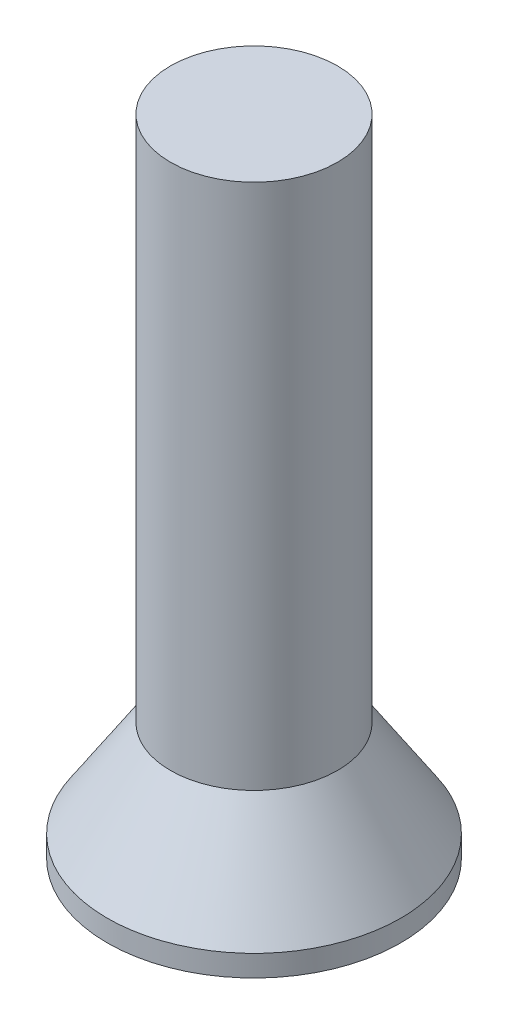
ISO-10303-21;
HEADER;
FILE_DESCRIPTION(('STEP AP214'),'2;1');
FILE_NAME('part.step','',(''),(''),'','','');
FILE_SCHEMA(('AUTOMOTIVE_DESIGN { 1 0 10303 214 1 1 1 1 }'));
ENDSEC;
DATA;
#1=APPLICATION_CONTEXT('core data for automotive mechanical design processes');
#2=APPLICATION_PROTOCOL_DEFINITION('international standard','automotive_design',2000,#1);
#3=PRODUCT_CONTEXT('',#1,'mechanical');
#4=PRODUCT('Part','Part','',(#3));
#5=PRODUCT_RELATED_PRODUCT_CATEGORY('part','',(#4));
#6=PRODUCT_DEFINITION_FORMATION('','',#4);
#7=PRODUCT_DEFINITION_CONTEXT('part definition',#1,'design');
#8=PRODUCT_DEFINITION('design','',#6,#7);
#9=PRODUCT_DEFINITION_SHAPE('','',#8);
#10=(LENGTH_UNIT() NAMED_UNIT(*) SI_UNIT(.MILLI.,.METRE.));
#11=(NAMED_UNIT(*) PLANE_ANGLE_UNIT() SI_UNIT($,.RADIAN.));
#12=(NAMED_UNIT(*) SI_UNIT($,.STERADIAN.) SOLID_ANGLE_UNIT());
#13=UNCERTAINTY_MEASURE_WITH_UNIT(LENGTH_MEASURE(1.E-05),#10,'distance_accuracy_value','');
#14=(GEOMETRIC_REPRESENTATION_CONTEXT(3) GLOBAL_UNCERTAINTY_ASSIGNED_CONTEXT((#13)) GLOBAL_UNIT_ASSIGNED_CONTEXT((#10,
#11,#12)) REPRESENTATION_CONTEXT('',''));
#15=CARTESIAN_POINT('',(0.,0.,0.));
#16=DIRECTION('',(0.,0.,1.));
#17=DIRECTION('',(1.,0.,0.));
#18=AXIS2_PLACEMENT_3D('',#15,#16,#17);
#19=CARTESIAN_POINT('',(0.,1.,0.));
#20=DIRECTION('',(0.,-1.,0.));
#21=DIRECTION('',(0.,0.,-1.));
#22=AXIS2_PLACEMENT_3D('',#19,#20,#21);
#23=CYLINDRICAL_SURFACE('',#22,6.85);
#24=CARTESIAN_POINT('',(-6.85,1.,0.));
#25=CARTESIAN_POINT('',(-6.84999812345427,0.999998671016254,-0.227513955360011));
#26=CARTESIAN_POINT('',(-6.83865302341798,1.0003211614898,-0.455067864432986));
#27=CARTESIAN_POINT('',(-6.79336509384239,1.00102410847341,-0.908046984716592));
#28=CARTESIAN_POINT('',(-6.75940731692302,1.00140460319696,-1.13347068779542));
#29=CARTESIAN_POINT('',(-6.66913555062974,1.00192474815454,-1.5802420142607));
#30=CARTESIAN_POINT('',(-6.61277952993837,1.0020639429301,-1.80158115092519));
#31=CARTESIAN_POINT('',(-6.47828634379006,1.00202979301861,-2.237477439852));
#32=CARTESIAN_POINT('',(-6.40015592107887,1.0018565449931,-2.4520366687433));
#33=CARTESIAN_POINT('',(-6.23666512093163,1.00133143729471,-2.83965489807855));
#34=CARTESIAN_POINT('',(-6.15430695043756,1.00101145779988,-3.01398808189051));
#35=CARTESIAN_POINT('',(-5.97516235080214,1.00031171588125,-3.35515428338137));
#36=CARTESIAN_POINT('',(-5.87837160264885,0.999931935559884,-3.52198503640646));
#37=CARTESIAN_POINT('',(-5.67119243566001,0.999218877528438,-3.84670348787193));
#38=CARTESIAN_POINT('',(-5.56081986326337,0.998885546574836,-4.00460130041875));
#39=CARTESIAN_POINT('',(-5.3271695379895,0.998352452619782,-4.31054673182821));
#40=CARTESIAN_POINT('',(-5.20389155353915,0.998152692015574,-4.45859417385903));
#41=CARTESIAN_POINT('',(-4.94525362740014,0.997937343125588,-4.74384311758573));
#42=CARTESIAN_POINT('',(-4.80988864483397,0.997921832045855,-4.88104004867619));
#43=CARTESIAN_POINT('',(-4.52808347540876,0.998079078317952,-5.14354356769262));
#44=CARTESIAN_POINT('',(-4.3816433154995,0.998251835211674,-5.2688501845502));
#45=CARTESIAN_POINT('',(-4.07869959935133,0.998741962088488,-5.50670538184579));
#46=CARTESIAN_POINT('',(-3.92219412964626,0.99905935963871,-5.61925152515062));
#47=CARTESIAN_POINT('',(-3.6002611149717,0.999755939477201,-5.83075577147306));
#48=CARTESIAN_POINT('',(-3.43483375788563,1.00013512046473,-5.92971416047575));
#49=CARTESIAN_POINT('',(-3.09621620096631,1.0008506448194,-6.11334967042798));
#50=CARTESIAN_POINT('',(-2.92302537046709,1.00118698469779,-6.19802562847301));
#51=CARTESIAN_POINT('',(-2.57018601202542,1.00171546852083,-6.35245757782905));
#52=CARTESIAN_POINT('',(-2.39053973702699,1.00190766226989,-6.42221871644692));
#53=CARTESIAN_POINT('',(-2.02598155929917,1.00208086232194,-6.54637178676389));
#54=CARTESIAN_POINT('',(-1.84106884899934,1.00206183606004,-6.60076134722049));
#55=CARTESIAN_POINT('',(-1.46731899006425,1.00181568028338,-6.6937702318287));
#56=CARTESIAN_POINT('',(-1.27848183892677,1.00158855063592,-6.73238954592486));
#57=CARTESIAN_POINT('',(-0.898227411436452,1.00102524830392,-6.79358313035189));
#58=CARTESIAN_POINT('',(-0.706810158337971,1.00068907660154,-6.81615754519639));
#59=CARTESIAN_POINT('',(-0.322754194419421,1.00016162949675,-6.84510144669493));
#60=CARTESIAN_POINT('',(-0.130115484561225,0.999970353980257,-6.85147094610843));
#61=CARTESIAN_POINT('',(0.255012935510077,1.00004587197948,-6.84795972186996));
#62=CARTESIAN_POINT('',(0.447502646282845,1.00031266376619,-6.83807905955514));
#63=CARTESIAN_POINT('',(0.830965586966271,1.00090256540496,-6.80213791000121));
#64=CARTESIAN_POINT('',(1.02193881521558,1.0012256753187,-6.77607740503916));
#65=CARTESIAN_POINT('',(1.4009811919649,1.00173692119812,-6.70796718995334));
#66=CARTESIAN_POINT('',(1.5890507981708,1.00192507865373,-6.66592002718989));
#67=CARTESIAN_POINT('',(1.96104492829404,1.00208361398727,-6.56611762153783));
#68=CARTESIAN_POINT('',(2.14496799411025,1.0020539164202,-6.50835694359796));
#69=CARTESIAN_POINT('',(2.50722923301826,1.00179355395321,-6.37756797332195));
#70=CARTESIAN_POINT('',(2.68556935946898,1.00156296017569,-6.30454509115059));
#71=CARTESIAN_POINT('',(3.03552998320523,1.000977643275,-6.14370869467194));
#72=CARTESIAN_POINT('',(3.20714798201641,1.00062287447633,-6.05588974407597));
#73=CARTESIAN_POINT('',(3.54233942546112,0.999893880774316,-5.86612433651913));
#74=CARTESIAN_POINT('',(3.70591454455936,0.999519659954391,-5.76418083719668));
#75=CARTESIAN_POINT('',(4.0238994351081,0.99885343019828,-5.54687463255295));
#76=CARTESIAN_POINT('',(4.17830901298925,0.998561422997897,-5.4315116439743));
#77=CARTESIAN_POINT('',(4.47685942182926,0.998135174399942,-5.18818982852143));
#78=CARTESIAN_POINT('',(4.62100038664985,0.998000930945407,-5.06023116589633));
#79=CARTESIAN_POINT('',(4.89799099508889,0.99792403422613,-4.79262644366971));
#80=CARTESIAN_POINT('',(5.03084063921721,0.997981380952737,-4.65298038459594));
#81=CARTESIAN_POINT('',(5.28430745934125,0.998273278758808,-4.36298987405243));
#82=CARTESIAN_POINT('',(5.40492431184354,0.998507834523141,-4.21264513983743));
#83=CARTESIAN_POINT('',(5.63306165888007,0.999094278225813,-3.9023327227402));
#84=CARTESIAN_POINT('',(5.74058242997871,0.999446163685786,-3.74236524317872));
#85=CARTESIAN_POINT('',(5.94178604045167,1.00017387959336,-3.41390941075433));
#86=CARTESIAN_POINT('',(6.03546617179838,1.00054971470636,-3.24541939902633));
#87=CARTESIAN_POINT('',(6.20826538371145,1.00121842150677,-2.90120874994971));
#88=CARTESIAN_POINT('',(6.28738981874729,1.00151132372339,-2.72549080069876));
#89=CARTESIAN_POINT('',(6.43058637630595,1.00192224080792,-2.36794433763354));
#90=CARTESIAN_POINT('',(6.49465251514832,1.00204018625219,-2.18611342742061));
#91=CARTESIAN_POINT('',(6.60721553155942,1.00205572477161,-1.81776640259537));
#92=CARTESIAN_POINT('',(6.65571814573939,1.00195339914466,-1.63125204166782));
#93=CARTESIAN_POINT('',(6.73684919080952,1.00156510961705,-1.25477293038916));
#94=CARTESIAN_POINT('',(6.76947468154498,1.00127911172636,-1.06480754772269));
#95=CARTESIAN_POINT('',(6.81860622146753,1.00067316301555,-0.682778608437009));
#96=CARTESIAN_POINT('',(6.83511227967763,1.00035321221443,-0.490715052992335));
#97=CARTESIAN_POINT('',(6.84769455137506,1.00006681162223,-0.202139120838173));
#98=CARTESIAN_POINT('',(6.84985876487775,1.00000360251516,-0.105857019683592));
#99=CARTESIAN_POINT('',(6.85012785711131,0.999996789835058,0.0867113328807578));
#100=CARTESIAN_POINT('',(6.84823280021134,1.00005318436542,0.182997584200506));
#101=CARTESIAN_POINT('',(6.83645750424812,1.00032472499748,0.471601864435809));
#102=CARTESIAN_POINT('',(6.82048893255141,1.000642208493,0.663706647718759));
#103=CARTESIAN_POINT('',(6.77242730335757,1.00124976245393,1.04586294827428));
#104=CARTESIAN_POINT('',(6.74033425769004,1.00153983293946,1.23591446705312));
#105=CARTESIAN_POINT('',(6.66025182325294,1.00193950082315,1.61264528960369));
#106=CARTESIAN_POINT('',(6.61226244488331,1.00204909833938,1.79932459558156));
#107=CARTESIAN_POINT('',(6.50073928973736,1.00204769661003,2.16793963917702));
#108=CARTESIAN_POINT('',(6.43720851026014,1.00193673987097,2.3498762839817));
#109=CARTESIAN_POINT('',(6.29502302463186,1.00153734036734,2.70781885772125));
#110=CARTESIAN_POINT('',(6.21636273701247,1.00124883201506,2.88382256967202));
#111=CARTESIAN_POINT('',(6.04452475307488,1.00058564178924,3.22851233282651));
#112=CARTESIAN_POINT('',(5.95135245402252,1.00021099192863,3.39720107489391));
#113=CARTESIAN_POINT('',(5.75109379786822,0.999481935908755,3.72619360227303));
#114=CARTESIAN_POINT('',(5.64400224775954,0.999127537376278,3.88649422667422));
#115=CARTESIAN_POINT('',(5.4167385240415,0.998533576661894,4.19744129908963));
#116=CARTESIAN_POINT('',(5.29657151760604,0.998293969317468,4.34809152363723));
#117=CARTESIAN_POINT('',(5.04391899831364,0.997990509025552,4.63880203853035));
#118=CARTESIAN_POINT('',(4.91142792940981,0.997926735750068,4.77885750034943));
#119=CARTESIAN_POINT('',(4.63511577878047,0.997991188558443,5.04730671706586));
#120=CARTESIAN_POINT('',(4.49129468822251,0.998119414791979,5.17570046287202));
#121=CARTESIAN_POINT('',(4.19341319839991,0.998535454633147,5.41985751826316));
#122=CARTESIAN_POINT('',(4.03935746524656,0.998823195949245,5.53562652090516));
#123=CARTESIAN_POINT('',(3.72198254899781,0.999484022801287,5.75381993092069));
#124=CARTESIAN_POINT('',(3.55865985324222,0.999857140864184,5.85623922890197));
#125=CARTESIAN_POINT('',(3.22402866124368,1.00058725960951,6.04691734910725));
#126=CARTESIAN_POINT('',(3.05272317623394,1.00094426627097,6.13518145597424));
#127=CARTESIAN_POINT('',(2.70322214662965,1.00153757832852,6.29699829840565));
#128=CARTESIAN_POINT('',(2.52502407879132,1.00177383906323,6.37054558441783));
#129=CARTESIAN_POINT('',(2.1631317321509,1.00204710672597,6.50234045940906));
#130=CARTESIAN_POINT('',(1.97943950806699,1.00208418722971,6.56059369033541));
#131=CARTESIAN_POINT('',(1.60776276381567,1.00193954664055,6.66143262419724));
#132=CARTESIAN_POINT('',(1.41977735685994,1.00175777993472,6.70401505855314));
#133=CARTESIAN_POINT('',(1.0408877648455,1.00125544744646,6.7731926329096));
#134=CARTESIAN_POINT('',(0.849983578504916,1.00093488160305,6.79978776588864));
#135=CARTESIAN_POINT('',(0.466612633280605,1.00033863347983,6.83680177897605));
#136=CARTESIAN_POINT('',(0.274145869673744,1.00006295133573,6.84722061017069));
#137=CARTESIAN_POINT('',(-0.110981302097608,0.999964452918771,6.85180772485686));
#138=CARTESIAN_POINT('',(-0.30364171020301,1.00014163650776,6.84597601330557));
#139=CARTESIAN_POINT('',(-0.687782718773651,1.00065633386283,6.8181038167319));
#140=CARTESIAN_POINT('',(-0.879263339807614,1.00099384482566,6.79606361510359));
#141=CARTESIAN_POINT('',(-1.25968755030747,1.00156398580578,6.7359314000328));
#142=CARTESIAN_POINT('',(-1.44863113987964,1.00179661582746,6.69783938726275));
#143=CARTESIAN_POINT('',(-1.82260420687335,1.00205575579831,6.60588262228597));
#144=CARTESIAN_POINT('',(-2.00763438522154,1.00208230297593,6.55202072070206));
#145=CARTESIAN_POINT('',(-2.37256826968795,1.00192284323992,6.42888158641615));
#146=CARTESIAN_POINT('',(-2.55247005607219,1.00173675777421,6.35959866440117));
#147=CARTESIAN_POINT('',(-2.90573606736112,1.00121766264818,6.20614786807209));
#148=CARTESIAN_POINT('',(-3.07910249741897,1.00088470303646,6.12198507005017));
#149=CARTESIAN_POINT('',(-3.41819412112531,1.00017221980607,5.93932234895702));
#150=CARTESIAN_POINT('',(-3.58391642957054,0.999792678800374,5.84081706982212));
#151=CARTESIAN_POINT('',(-3.90639485396573,0.999092326473133,5.63024377406383));
#152=CARTESIAN_POINT('',(-4.06315521586582,0.99877148717894,5.518182259796));
#153=CARTESIAN_POINT('',(-4.3667504597058,0.998271987009771,5.28120153320391));
#154=CARTESIAN_POINT('',(-4.51358081522726,0.998093390579259,5.15627652186326));
#155=CARTESIAN_POINT('',(-4.79617490796822,0.997923861741039,4.89451689831475));
#156=CARTESIAN_POINT('',(-4.93194012440357,0.997932904207839,4.75768388307279));
#157=CARTESIAN_POINT('',(-5.19140165043189,0.99813627330161,4.47313142855684));
#158=CARTESIAN_POINT('',(-5.31510339518571,0.998330516058048,4.32541694504706));
#159=CARTESIAN_POINT('',(-5.54972338754451,0.998855145083524,4.01997333972199));
#160=CARTESIAN_POINT('',(-5.6606312716668,0.99918564074485,3.86223625741406));
#161=CARTESIAN_POINT('',(-5.86872037417951,0.999895867483293,3.53803742884665));
#162=CARTESIAN_POINT('',(-5.96590670867362,1.00027558010795,3.37157896627784));
#163=CARTESIAN_POINT('',(-6.14600883912804,1.00097900464599,3.03088163935197));
#164=CARTESIAN_POINT('',(-6.22890904103763,1.00130265536687,2.85663453121294));
#165=CARTESIAN_POINT('',(-6.37969124202461,1.0017942668633,2.50183529770445));
#166=CARTESIAN_POINT('',(-6.4475788185532,1.00196228553309,2.32128554284018));
#167=CARTESIAN_POINT('',(-6.56780320905032,1.0020826742106,1.95537562584683));
#168=CARTESIAN_POINT('',(-6.62016267672562,1.00203536002885,1.77002290456609));
#169=CARTESIAN_POINT('',(-6.70907600204638,1.00173856102302,1.39563599242325));
#170=CARTESIAN_POINT('',(-6.74563602434741,1.00148915516084,1.20660326757281));
#171=CARTESIAN_POINT('',(-6.7994018848082,1.0009421467823,0.848256045685322));
#172=CARTESIAN_POINT('',(-6.81836307324862,1.00065351273106,0.679202790815732));
#173=CARTESIAN_POINT('',(-6.84366484659513,1.00018291900912,0.340107330820523));
#174=CARTESIAN_POINT('',(-6.85000140270264,1.00000099340452,0.17006482736027));
#175=CARTESIAN_POINT('',(-6.85,1.,0.));
#176=B_SPLINE_CURVE_WITH_KNOTS('',3,(#24,#25,#26,#27,#28,#29,#30,#31,#32,#33,#34,#35,#36,#37,
#38,#39,#40,#41,#42,#43,#44,#45,#46,#47,#48,#49,#50,#51,#52,#53,#54,#55,#56,#57,#58,#59,#60,#61,
#62,#63,#64,#65,#66,#67,#68,#69,#70,#71,#72,#73,#74,#75,#76,#77,#78,#79,#80,#81,#82,#83,#84,#85,
#86,#87,#88,#89,#90,#91,#92,#93,#94,#95,#96,#97,#98,#99,#100,#101,#102,#103,#104,#105,#106,#107,
#108,#109,#110,#111,#112,#113,#114,#115,#116,#117,#118,#119,#120,#121,#122,#123,#124,#125,#126,
#127,#128,#129,#130,#131,#132,#133,#134,#135,#136,#137,#138,#139,#140,#141,#142,#143,#144,#145,
#146,#147,#148,#149,#150,#151,#152,#153,#154,#155,#156,#157,#158,#159,#160,#161,#162,#163,#164,
#165,#166,#167,#168,#169,#170,#171,#172,#173,#174,#175),.UNSPECIFIED.,.T.,.F.,(4,2,2,2,2,2,2,2,
2,2,2,2,2,2,2,2,2,2,2,2,2,2,2,2,2,2,2,2,2,2,2,2,2,2,2,2,2,2,2,2,2,2,2,2,2,2,2,2,2,2,2,2,2,2,2,2,
2,2,2,2,2,2,2,2,2,2,2,2,2,2,2,2,2,2,2,4),(0.,0.682329648962787,1.36511077822833,
2.04917927296012,2.73303617131213,3.31079785975066,3.8887327941862,4.46599971166182,
5.04327698931952,5.62079615484211,6.19831391510401,6.7759417908061,7.35355750715652,
7.93122023147122,8.50868327356916,9.08623534741272,9.66378778951581,10.2413350296381,
10.8188818150098,11.3964264204035,11.9739716584246,12.5514249072586,13.1290781423536,
13.7065269564672,14.2841883981166,14.8617290614788,15.43928191773,16.0168272436192,
16.5943725434287,17.1719331123142,17.7494814821004,18.3271427044421,18.9045910010922,
19.4822683705718,20.0597325667875,20.6373036582234,21.2148744263579,21.5037198103057,
21.792560613973,22.370118818138,22.9476765985823,23.5252340011685,24.1026801043041,
24.6803396446788,25.2577848543271,25.8354461194779,26.4128799272136,26.9905753324611,
27.5682711880614,28.1457054482159,28.7233600674537,29.300798522825,29.8784504061769,
30.4558888944956,31.0334477554681,31.611006870101,32.1885677311473,32.7661284160096,
33.3436790028685,33.9212295655334,34.4986757924333,35.0763354120752,35.6537983411989,
36.2314774741262,36.808880609241,37.3865451936918,37.9641324273773,38.5414582168119,
39.119248424687,39.6968226303254,40.2750233486776,40.8530088931763,41.4301470284203,
42.007059771118,42.5169329369075,43.0269687884227),.UNSPECIFIED.);
#177=CARTESIAN_POINT('',(-6.85,1.,0.));
#178=VERTEX_POINT('',#177);
#179=EDGE_CURVE('E57',#178,#178,#176,.F.);
#180=ORIENTED_EDGE('',*,*,#179,.F.);
#181=EDGE_LOOP('',(#180));
#182=FACE_BOUND('',#181,.T.);
#183=CARTESIAN_POINT('',(0.,0.,0.));
#184=DIRECTION('',(0.,1.,0.));
#185=DIRECTION('',(0.,0.,1.));
#186=AXIS2_PLACEMENT_3D('',#183,#184,#185);
#187=CIRCLE('',#186,6.85);
#188=CARTESIAN_POINT('',(0.,0.,6.85));
#189=VERTEX_POINT('',#188);
#190=EDGE_CURVE('E68',#189,#189,#187,.T.);
#191=ORIENTED_EDGE('',*,*,#190,.T.);
#192=EDGE_LOOP('',(#191));
#193=FACE_BOUND('',#192,.T.);
#194=ADVANCED_FACE('F53',(#182,#193),#23,.T.);
#195=CARTESIAN_POINT('',(0.,0.,0.));
#196=DIRECTION('',(0.,1.,0.));
#197=DIRECTION('',(0.,0.,1.));
#198=AXIS2_PLACEMENT_3D('',#195,#196,#197);
#199=PLANE('',#198);
#200=ORIENTED_EDGE('',*,*,#190,.F.);
#201=EDGE_LOOP('',(#200));
#202=FACE_BOUND('',#201,.T.);
#203=ADVANCED_FACE('F95',(#202),#199,.F.);
#204=CARTESIAN_POINT('',(6.8795,0.955,0.));
#205=CARTESIAN_POINT('',(6.86966666666666,0.97,0.));
#206=CARTESIAN_POINT('',(6.85983333333333,0.985,0.));
#207=CARTESIAN_POINT('',(6.85,1.,0.));
#208=CARTESIAN_POINT('',(5.86666666666667,2.5,0.));
#209=CARTESIAN_POINT('',(4.88333333333333,4.,0.));
#210=CARTESIAN_POINT('',(3.9,5.5,0.));
#211=CARTESIAN_POINT('',(6.8795,0.955,-0.189844965538296));
#212=CARTESIAN_POINT('',(6.86966666666666,0.97,-0.189573607325084));
#213=CARTESIAN_POINT('',(6.85983333333333,0.985,-0.189302249111872));
#214=CARTESIAN_POINT('',(6.85,1.,-0.18903089089866));
#215=CARTESIAN_POINT('',(5.86666666666667,2.5,-0.161895069577441));
#216=CARTESIAN_POINT('',(4.88333333333333,4.,-0.134759248256222));
#217=CARTESIAN_POINT('',(3.9,5.5,-0.107623426935003));
#218=CARTESIAN_POINT('',(6.86408699655383,0.955,-0.565963403507232));
#219=CARTESIAN_POINT('',(6.85427569406584,0.97,-0.565154433843571));
#220=CARTESIAN_POINT('',(6.84446439157785,0.985,-0.56434546417991));
#221=CARTESIAN_POINT('',(6.83465308908987,1.,-0.56353649451625));
#222=CARTESIAN_POINT('',(5.85352284029108,2.5,-0.48263952815017));
#223=CARTESIAN_POINT('',(4.87239259149229,4.,-0.40174256178409));
#224=CARTESIAN_POINT('',(3.8912623426935,5.5,-0.320845595418011));
#225=CARTESIAN_POINT('',(6.79650470759684,0.955,-1.11765035458688));
#226=CARTESIAN_POINT('',(6.7867900050325,0.97,-1.11605282155588));
#227=CARTESIAN_POINT('',(6.77707530246816,0.985,-1.11445528852488));
#228=CARTESIAN_POINT('',(6.76736059990382,1.,-1.11285775549388));
#229=CARTESIAN_POINT('',(5.79589034346994,2.5,-0.953104452393786));
#230=CARTESIAN_POINT('',(4.82442008703606,4.,-0.793351149293691));
#231=CARTESIAN_POINT('',(3.85294983060218,5.5,-0.633597846193596));
#232=CARTESIAN_POINT('',(6.68623586140289,0.955,-1.655070373242));
#233=CARTESIAN_POINT('',(6.67667877353743,0.97,-1.6527046695324));
#234=CARTESIAN_POINT('',(6.66712168567196,0.985,-1.6503389658228));
#235=CARTESIAN_POINT('',(6.6575645978065,1.,-1.64797326211319));
#236=CARTESIAN_POINT('',(5.70185581126007,2.5,-1.41140289115291));
#237=CARTESIAN_POINT('',(4.74614702471364,4.,-1.17483252019262));
#238=CARTESIAN_POINT('',(3.79043823816721,5.5,-0.938262149232329));
#239=CARTESIAN_POINT('',(5.77916080012213,0.955,-4.78333153132086));
#240=CARTESIAN_POINT('',(5.77090025581883,0.97,-4.7764943929545));
#241=CARTESIAN_POINT('',(5.76263971151553,0.985,-4.76965725458815));
#242=CARTESIAN_POINT('',(5.75437916721224,1.,-4.7628201162218));
#243=CARTESIAN_POINT('',(4.9283247368825,2.5,-4.07910627958655));
#244=CARTESIAN_POINT('',(4.10227030655276,4.,-3.39539244295131));
#245=CARTESIAN_POINT('',(3.27621587622303,5.5,-2.71167860631606));
#246=CARTESIAN_POINT('',(3.03751944861277,0.955,-6.8795));
#247=CARTESIAN_POINT('',(3.03317771720138,0.97,-6.86966666666666));
#248=CARTESIAN_POINT('',(3.02883598578998,0.985,-6.85983333333333));
#249=CARTESIAN_POINT('',(3.02449425437859,1.,-6.85));
#250=CARTESIAN_POINT('',(2.59032111323908,2.5,-5.86666666666667));
#251=CARTESIAN_POINT('',(2.15614797209958,4.,-4.88333333333333));
#252=CARTESIAN_POINT('',(1.72197483096007,5.5,-3.9));
#253=CARTESIAN_POINT('',(-3.79689931076597,0.955,-6.8795));
#254=CARTESIAN_POINT('',(-3.79147214650172,0.97,-6.86966666666667));
#255=CARTESIAN_POINT('',(-3.78604498223748,0.985,-6.85983333333333));
#256=CARTESIAN_POINT('',(-3.78061781797323,1.,-6.85));
#257=CARTESIAN_POINT('',(-3.23790139154885,2.5,-5.86666666666667));
#258=CARTESIAN_POINT('',(-2.69518496512447,4.,-4.88333333333333));
#259=CARTESIAN_POINT('',(-2.15246853870009,5.5,-3.9));
#260=CARTESIAN_POINT('',(-6.8795,0.955,-3.79689931076597));
#261=CARTESIAN_POINT('',(-6.86966666666666,0.97,-3.79147214650172));
#262=CARTESIAN_POINT('',(-6.85983333333333,0.985,-3.78604498223748));
#263=CARTESIAN_POINT('',(-6.85,1.,-3.78061781797324));
#264=CARTESIAN_POINT('',(-5.86666666666667,2.5,-3.23790139154885));
#265=CARTESIAN_POINT('',(-4.88333333333333,4.,-2.69518496512447));
#266=CARTESIAN_POINT('',(-3.9,5.5,-2.15246853870009));
#267=CARTESIAN_POINT('',(-6.8795,0.955,3.79689931076596));
#268=CARTESIAN_POINT('',(-6.86966666666667,0.97,3.79147214650172));
#269=CARTESIAN_POINT('',(-6.85983333333333,0.985,3.78604498223748));
#270=CARTESIAN_POINT('',(-6.85,1.,3.78061781797323));
#271=CARTESIAN_POINT('',(-5.86666666666667,2.5,3.23790139154885));
#272=CARTESIAN_POINT('',(-4.88333333333333,4.,2.69518496512447));
#273=CARTESIAN_POINT('',(-3.9,5.5,2.15246853870009));
#274=CARTESIAN_POINT('',(-3.79689931076597,0.955,6.8795));
#275=CARTESIAN_POINT('',(-3.79147214650172,0.97,6.86966666666666));
#276=CARTESIAN_POINT('',(-3.78604498223748,0.985,6.85983333333333));
#277=CARTESIAN_POINT('',(-3.78061781797324,1.,6.85));
#278=CARTESIAN_POINT('',(-3.23790139154886,2.5,5.86666666666667));
#279=CARTESIAN_POINT('',(-2.69518496512447,4.,4.88333333333333));
#280=CARTESIAN_POINT('',(-2.15246853870009,5.5,3.9));
#281=CARTESIAN_POINT('',(3.03751944861277,0.955,6.8795));
#282=CARTESIAN_POINT('',(3.03317771720138,0.97,6.86966666666667));
#283=CARTESIAN_POINT('',(3.02883598578998,0.985,6.85983333333333));
#284=CARTESIAN_POINT('',(3.02449425437859,1.,6.85));
#285=CARTESIAN_POINT('',(2.59032111323908,2.5,5.86666666666667));
#286=CARTESIAN_POINT('',(2.15614797209958,4.,4.88333333333333));
#287=CARTESIAN_POINT('',(1.72197483096007,5.5,3.9));
#288=CARTESIAN_POINT('',(5.77916080012213,0.955,4.78333153132086));
#289=CARTESIAN_POINT('',(5.77090025581883,0.97,4.7764943929545));
#290=CARTESIAN_POINT('',(5.76263971151553,0.985,4.76965725458815));
#291=CARTESIAN_POINT('',(5.75437916721224,1.,4.7628201162218));
#292=CARTESIAN_POINT('',(4.9283247368825,2.5,4.07910627958655));
#293=CARTESIAN_POINT('',(4.10227030655276,4.,3.39539244295131));
#294=CARTESIAN_POINT('',(3.27621587622303,5.5,2.71167860631606));
#295=CARTESIAN_POINT('',(6.68623586140289,0.955,1.655070373242));
#296=CARTESIAN_POINT('',(6.67667877353743,0.97,1.6527046695324));
#297=CARTESIAN_POINT('',(6.66712168567196,0.985,1.6503389658228));
#298=CARTESIAN_POINT('',(6.6575645978065,1.,1.6479732621132));
#299=CARTESIAN_POINT('',(5.70185581126007,2.5,1.41140289115291));
#300=CARTESIAN_POINT('',(4.74614702471364,4.,1.17483252019262));
#301=CARTESIAN_POINT('',(3.79043823816721,5.5,0.938262149232331));
#302=CARTESIAN_POINT('',(6.79650470759684,0.955,1.11765035458689));
#303=CARTESIAN_POINT('',(6.7867900050325,0.97,1.11605282155589));
#304=CARTESIAN_POINT('',(6.77707530246816,0.985,1.11445528852488));
#305=CARTESIAN_POINT('',(6.76736059990382,1.,1.11285775549388));
#306=CARTESIAN_POINT('',(5.79589034346994,2.5,0.953104452393788));
#307=CARTESIAN_POINT('',(4.82442008703606,4.,0.793351149293693));
#308=CARTESIAN_POINT('',(3.85294983060218,5.5,0.633597846193598));
#309=CARTESIAN_POINT('',(6.86408699655383,0.955,0.565963403507237));
#310=CARTESIAN_POINT('',(6.85427569406584,0.97,0.565154433843576));
#311=CARTESIAN_POINT('',(6.84446439157785,0.985,0.564345464179915));
#312=CARTESIAN_POINT('',(6.83465308908986,1.,0.563536494516254));
#313=CARTESIAN_POINT('',(5.85352284029108,2.5,0.482639528150174));
#314=CARTESIAN_POINT('',(4.87239259149229,4.,0.401742561784093));
#315=CARTESIAN_POINT('',(3.8912623426935,5.5,0.320845595418013));
#316=CARTESIAN_POINT('',(6.8795,0.955,0.189844965538299));
#317=CARTESIAN_POINT('',(6.86966666666666,0.97,0.189573607325087));
#318=CARTESIAN_POINT('',(6.85983333333333,0.985,0.189302249111875));
#319=CARTESIAN_POINT('',(6.85,1.,0.189030890898662));
#320=CARTESIAN_POINT('',(5.86666666666667,2.5,0.161895069577443));
#321=CARTESIAN_POINT('',(4.88333333333333,4.,0.134759248256224));
#322=CARTESIAN_POINT('',(3.9,5.5,0.107623426935005));
#323=CARTESIAN_POINT('',(6.8795,0.955,0.));
#324=CARTESIAN_POINT('',(6.86966666666666,0.97,0.));
#325=CARTESIAN_POINT('',(6.85983333333333,0.985,0.));
#326=CARTESIAN_POINT('',(6.85,1.,0.));
#327=CARTESIAN_POINT('',(5.86666666666667,2.5,0.));
#328=CARTESIAN_POINT('',(4.88333333333333,4.,0.));
#329=CARTESIAN_POINT('',(3.9,5.5,0.));
#330=B_SPLINE_SURFACE_WITH_KNOTS('',3,3,((#204,#205,#206,#207,#208,#209,#210),(#211,#212,#213,
#214,#215,#216,#217),(#218,#219,#220,#221,#222,#223,#224),(#225,#226,#227,#228,#229,#230,#231),
(#232,#233,#234,#235,#236,#237,#238),(#239,#240,#241,#242,#243,#244,#245),(#246,#247,#248,#249,
#250,#251,#252),(#253,#254,#255,#256,#257,#258,#259),(#260,#261,#262,#263,#264,#265,#266),(#267,
#268,#269,#270,#271,#272,#273),(#274,#275,#276,#277,#278,#279,#280),(#281,#282,#283,#284,#285,
#286,#287),(#288,#289,#290,#291,#292,#293,#294),(#295,#296,#297,#298,#299,#300,#301),(#302,#303,
#304,#305,#306,#307,#308),(#309,#310,#311,#312,#313,#314,#315),(#316,#317,#318,#319,#320,#321,
#322),(#323,#324,#325,#326,#327,#328,#329)),.UNSPECIFIED.,.T.,.F.,.F.,(4,1,1,1,1,2,2,2,1,1,1,1,
4),(4,3,4),(0.,0.0125,0.0249999999999999,0.0375000000000001,0.05,0.25,0.5,0.75,0.95,0.9625,
0.975,0.9875,1.),(-0.01,0.,1.),.UNSPECIFIED.);
#331=CARTESIAN_POINT('',(3.9,5.5,0.));
#332=CARTESIAN_POINT('',(3.9,5.5,0.107623426935005));
#333=CARTESIAN_POINT('',(3.8912623426935,5.5,0.320845595418013));
#334=CARTESIAN_POINT('',(3.85294983060218,5.5,0.633597846193598));
#335=CARTESIAN_POINT('',(3.79043823816721,5.5,0.938262149232331));
#336=CARTESIAN_POINT('',(3.27621587622303,5.5,2.71167860631606));
#337=CARTESIAN_POINT('',(1.72197483096007,5.5,3.9));
#338=CARTESIAN_POINT('',(-2.15246853870009,5.5,3.9));
#339=CARTESIAN_POINT('',(-3.9,5.5,2.15246853870009));
#340=CARTESIAN_POINT('',(-3.9,5.5,-2.15246853870009));
#341=CARTESIAN_POINT('',(-2.15246853870009,5.5,-3.9));
#342=CARTESIAN_POINT('',(1.72197483096007,5.5,-3.9));
#343=CARTESIAN_POINT('',(3.27621587622303,5.5,-2.71167860631606));
#344=CARTESIAN_POINT('',(3.79043823816721,5.5,-0.938262149232329));
#345=CARTESIAN_POINT('',(3.85294983060218,5.5,-0.633597846193596));
#346=CARTESIAN_POINT('',(3.8912623426935,5.5,-0.320845595418011));
#347=CARTESIAN_POINT('',(3.9,5.5,-0.107623426935003));
#348=CARTESIAN_POINT('',(3.9,5.5,0.));
#349=B_SPLINE_CURVE_WITH_KNOTS('',3,(#331,#332,#333,#334,#335,#336,#337,#338,#339,#340,#341,
#342,#343,#344,#345,#346,#347,#348),.UNSPECIFIED.,.T.,.F.,(4,1,1,1,1,2,2,2,1,1,1,1,4),(0.,
0.0125,0.025,0.0375,0.05,0.25,0.5,0.75,0.95,0.9625,0.975,0.9875,1.),.UNSPECIFIED.);
#350=CARTESIAN_POINT('',(3.9,5.5,0.));
#351=VERTEX_POINT('',#350);
#352=EDGE_CURVE('E12',#351,#351,#349,.T.);
#353=ORIENTED_EDGE('',*,*,#179,.T.);
#354=EDGE_LOOP('',(#353));
#355=FACE_BOUND('',#354,.T.);
#356=ORIENTED_EDGE('',*,*,#352,.T.);
#357=EDGE_LOOP('',(#356));
#358=FACE_BOUND('',#357,.T.);
#359=ADVANCED_FACE('F97',(#355,#358),#330,.T.);
#360=CARTESIAN_POINT('',(0.,30.1,0.));
#361=DIRECTION('',(0.,1.,0.));
#362=DIRECTION('',(0.,0.,1.));
#363=AXIS2_PLACEMENT_3D('',#360,#361,#362);
#364=PLANE('',#363);
#365=CARTESIAN_POINT('',(0.,30.1,0.));
#366=DIRECTION('',(0.,1.,0.));
#367=DIRECTION('',(0.,0.,1.));
#368=AXIS2_PLACEMENT_3D('',#365,#366,#367);
#369=CIRCLE('',#368,3.9);
#370=CARTESIAN_POINT('',(0.,30.1,3.9));
#371=VERTEX_POINT('',#370);
#372=EDGE_CURVE('E72',#371,#371,#369,.T.);
#373=ORIENTED_EDGE('',*,*,#372,.T.);
#374=EDGE_LOOP('',(#373));
#375=FACE_BOUND('',#374,.T.);
#376=ADVANCED_FACE('F93',(#375),#364,.T.);
#377=CARTESIAN_POINT('',(0.,30.1,0.));
#378=DIRECTION('',(0.,-1.,0.));
#379=DIRECTION('',(0.,0.,-1.));
#380=AXIS2_PLACEMENT_3D('',#377,#378,#379);
#381=CYLINDRICAL_SURFACE('',#380,3.9);
#382=ORIENTED_EDGE('',*,*,#372,.F.);
#383=EDGE_LOOP('',(#382));
#384=FACE_BOUND('',#383,.T.);
#385=ORIENTED_EDGE('',*,*,#352,.F.);
#386=EDGE_LOOP('',(#385));
#387=FACE_BOUND('',#386,.T.);
#388=ADVANCED_FACE('F84',(#384,#387),#381,.T.);
#389=CLOSED_SHELL('',(#194,#203,#359,#376,#388));
#390=MANIFOLD_SOLID_BREP('B2',#389);
#391=ADVANCED_BREP_SHAPE_REPRESENTATION('',(#18,#390),#14);
#392=SHAPE_DEFINITION_REPRESENTATION(#9,#391);
ENDSEC;
END-ISO-10303-21;
